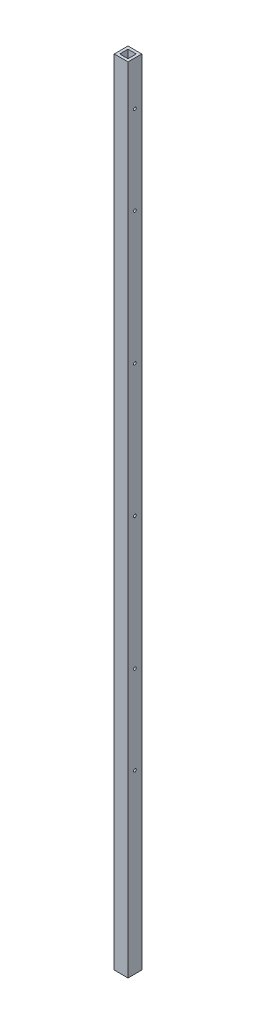
ISO-10303-21;
HEADER;
FILE_DESCRIPTION(('STEP AP214'),'2;1');
FILE_NAME('part.step','',(''),(''),'','','');
FILE_SCHEMA(('AUTOMOTIVE_DESIGN { 1 0 10303 214 1 1 1 1 }'));
ENDSEC;
DATA;
#1=APPLICATION_CONTEXT('core data for automotive mechanical design processes');
#2=APPLICATION_PROTOCOL_DEFINITION('international standard','automotive_design',2000,#1);
#3=PRODUCT_CONTEXT('',#1,'mechanical');
#4=PRODUCT('Part','Part','',(#3));
#5=PRODUCT_RELATED_PRODUCT_CATEGORY('part','',(#4));
#6=PRODUCT_DEFINITION_FORMATION('','',#4);
#7=PRODUCT_DEFINITION_CONTEXT('part definition',#1,'design');
#8=PRODUCT_DEFINITION('design','',#6,#7);
#9=PRODUCT_DEFINITION_SHAPE('','',#8);
#10=(LENGTH_UNIT() NAMED_UNIT(*) SI_UNIT(.MILLI.,.METRE.));
#11=(NAMED_UNIT(*) PLANE_ANGLE_UNIT() SI_UNIT($,.RADIAN.));
#12=(NAMED_UNIT(*) SI_UNIT($,.STERADIAN.) SOLID_ANGLE_UNIT());
#13=UNCERTAINTY_MEASURE_WITH_UNIT(LENGTH_MEASURE(1.E-05),#10,'distance_accuracy_value','');
#14=(GEOMETRIC_REPRESENTATION_CONTEXT(3) GLOBAL_UNCERTAINTY_ASSIGNED_CONTEXT((#13)) GLOBAL_UNIT_ASSIGNED_CONTEXT((#10,
#11,#12)) REPRESENTATION_CONTEXT('',''));
#15=CARTESIAN_POINT('',(0.,0.,0.));
#16=DIRECTION('',(0.,0.,1.));
#17=DIRECTION('',(1.,0.,0.));
#18=AXIS2_PLACEMENT_3D('',#15,#16,#17);
#19=CARTESIAN_POINT('',(0.,1828.8,0.));
#20=DIRECTION('',(1.,0.,0.));
#21=DIRECTION('',(0.,0.,-1.));
#22=AXIS2_PLACEMENT_3D('',#19,#20,#21);
#23=PLANE('',#22);
#24=CARTESIAN_POINT('',(0.,1524.,-15.875));
#25=DIRECTION('',(1.,0.,0.));
#26=DIRECTION('',(0.,0.,-1.));
#27=AXIS2_PLACEMENT_3D('',#24,#25,#26);
#28=CIRCLE('',#27,3.17500000000009);
#29=CARTESIAN_POINT('',(0.,1524.,-19.0500000000001));
#30=VERTEX_POINT('',#29);
#31=EDGE_CURVE('E210',#30,#30,#28,.T.);
#32=ORIENTED_EDGE('',*,*,#31,.T.);
#33=EDGE_LOOP('',(#32));
#34=FACE_BOUND('',#33,.T.);
#35=CARTESIAN_POINT('',(0.,1219.2,-15.875));
#36=DIRECTION('',(1.,0.,0.));
#37=DIRECTION('',(0.,0.,-1.));
#38=AXIS2_PLACEMENT_3D('',#35,#36,#37);
#39=CIRCLE('',#38,3.17500000000006);
#40=CARTESIAN_POINT('',(0.,1219.2,-19.0500000000001));
#41=VERTEX_POINT('',#40);
#42=EDGE_CURVE('E493',#41,#41,#39,.T.);
#43=ORIENTED_EDGE('',*,*,#42,.T.);
#44=EDGE_LOOP('',(#43));
#45=FACE_BOUND('',#44,.T.);
#46=CARTESIAN_POINT('',(0.,914.4,-15.875));
#47=DIRECTION('',(1.,0.,0.));
#48=DIRECTION('',(0.,0.,-1.));
#49=AXIS2_PLACEMENT_3D('',#46,#47,#48);
#50=CIRCLE('',#49,3.17500000000003);
#51=CARTESIAN_POINT('',(0.,914.4,-19.05));
#52=VERTEX_POINT('',#51);
#53=EDGE_CURVE('E494',#52,#52,#50,.T.);
#54=ORIENTED_EDGE('',*,*,#53,.T.);
#55=EDGE_LOOP('',(#54));
#56=FACE_BOUND('',#55,.T.);
#57=CARTESIAN_POINT('',(0.,609.6,-15.875));
#58=DIRECTION('',(1.,0.,0.));
#59=DIRECTION('',(0.,0.,-1.));
#60=AXIS2_PLACEMENT_3D('',#57,#58,#59);
#61=CIRCLE('',#60,3.175);
#62=CARTESIAN_POINT('',(0.,609.6,-19.05));
#63=VERTEX_POINT('',#62);
#64=EDGE_CURVE('E509',#63,#63,#61,.T.);
#65=ORIENTED_EDGE('',*,*,#64,.T.);
#66=EDGE_LOOP('',(#65));
#67=FACE_BOUND('',#66,.T.);
#68=CARTESIAN_POINT('',(0.,406.4,-15.875));
#69=DIRECTION('',(1.,0.,0.));
#70=DIRECTION('',(0.,0.,-1.));
#71=AXIS2_PLACEMENT_3D('',#68,#69,#70);
#72=CIRCLE('',#71,3.175);
#73=CARTESIAN_POINT('',(0.,406.4,-19.05));
#74=VERTEX_POINT('',#73);
#75=EDGE_CURVE('E517',#74,#74,#72,.T.);
#76=ORIENTED_EDGE('',*,*,#75,.T.);
#77=EDGE_LOOP('',(#76));
#78=FACE_BOUND('',#77,.T.);
#79=CARTESIAN_POINT('',(0.,1727.2,-15.875));
#80=DIRECTION('',(1.,0.,0.));
#81=DIRECTION('',(0.,0.,-1.));
#82=AXIS2_PLACEMENT_3D('',#79,#80,#81);
#83=CIRCLE('',#82,3.17500000000006);
#84=CARTESIAN_POINT('',(0.,1727.2,-19.0500000000001));
#85=VERTEX_POINT('',#84);
#86=EDGE_CURVE('E204',#85,#85,#83,.T.);
#87=ORIENTED_EDGE('',*,*,#86,.T.);
#88=EDGE_LOOP('',(#87));
#89=FACE_BOUND('',#88,.T.);
#90=DIRECTION('',(0.,0.,1.));
#91=VECTOR('',#90,1.);
#92=CARTESIAN_POINT('',(0.,0.,0.));
#93=LINE('',#92,#91);
#94=CARTESIAN_POINT('',(0.,0.,-31.75));
#95=VERTEX_POINT('',#94);
#96=CARTESIAN_POINT('',(0.,0.,0.));
#97=VERTEX_POINT('',#96);
#98=EDGE_CURVE('E158',#95,#97,#93,.T.);
#99=ORIENTED_EDGE('',*,*,#98,.T.);
#100=DIRECTION('',(0.,-1.,0.));
#101=VECTOR('',#100,1.);
#102=CARTESIAN_POINT('',(0.,1828.8,0.));
#103=LINE('',#102,#101);
#104=CARTESIAN_POINT('',(0.,1828.8,0.));
#105=VERTEX_POINT('',#104);
#106=EDGE_CURVE('E11',#105,#97,#103,.T.);
#107=ORIENTED_EDGE('',*,*,#106,.F.);
#108=DIRECTION('',(0.,0.,1.));
#109=VECTOR('',#108,1.);
#110=CARTESIAN_POINT('',(0.,1828.8,0.));
#111=LINE('',#110,#109);
#112=CARTESIAN_POINT('',(0.,1828.8,-31.75));
#113=VERTEX_POINT('',#112);
#114=EDGE_CURVE('E164',#113,#105,#111,.T.);
#115=ORIENTED_EDGE('',*,*,#114,.F.);
#116=DIRECTION('',(0.,-1.,0.));
#117=VECTOR('',#116,1.);
#118=CARTESIAN_POINT('',(0.,1828.8,-31.75));
#119=LINE('',#118,#117);
#120=EDGE_CURVE('E178',#113,#95,#119,.T.);
#121=ORIENTED_EDGE('',*,*,#120,.T.);
#122=EDGE_LOOP('',(#99,#107,#115,#121));
#123=FACE_BOUND('',#122,.T.);
#124=ADVANCED_FACE('F45',(#34,#45,#56,#67,#78,#89,#123),#23,.F.);
#125=CARTESIAN_POINT('',(0.,1828.8,0.));
#126=DIRECTION('',(0.,0.,-1.));
#127=DIRECTION('',(-1.,0.,0.));
#128=AXIS2_PLACEMENT_3D('',#125,#126,#127);
#129=PLANE('',#128);
#130=DIRECTION('',(1.,0.,0.));
#131=VECTOR('',#130,1.);
#132=CARTESIAN_POINT('',(0.,0.,0.));
#133=LINE('',#132,#131);
#134=CARTESIAN_POINT('',(31.75,0.,0.));
#135=VERTEX_POINT('',#134);
#136=EDGE_CURVE('E182',#97,#135,#133,.T.);
#137=ORIENTED_EDGE('',*,*,#136,.T.);
#138=DIRECTION('',(0.,-1.,0.));
#139=VECTOR('',#138,1.);
#140=CARTESIAN_POINT('',(31.75,1828.8,0.));
#141=LINE('',#140,#139);
#142=CARTESIAN_POINT('',(31.75,1828.8,0.));
#143=VERTEX_POINT('',#142);
#144=EDGE_CURVE('E54',#143,#135,#141,.T.);
#145=ORIENTED_EDGE('',*,*,#144,.F.);
#146=DIRECTION('',(1.,0.,0.));
#147=VECTOR('',#146,1.);
#148=CARTESIAN_POINT('',(0.,1828.8,0.));
#149=LINE('',#148,#147);
#150=EDGE_CURVE('E168',#105,#143,#149,.T.);
#151=ORIENTED_EDGE('',*,*,#150,.F.);
#152=ORIENTED_EDGE('',*,*,#106,.T.);
#153=EDGE_LOOP('',(#137,#145,#151,#152));
#154=FACE_BOUND('',#153,.T.);
#155=ADVANCED_FACE('F255',(#154),#129,.F.);
#156=CARTESIAN_POINT('',(31.75,1828.8,0.));
#157=DIRECTION('',(-1.,0.,0.));
#158=DIRECTION('',(0.,0.,1.));
#159=AXIS2_PLACEMENT_3D('',#156,#157,#158);
#160=PLANE('',#159);
#161=CARTESIAN_POINT('',(31.75,1524.,-15.875));
#162=DIRECTION('',(1.,0.,0.));
#163=DIRECTION('',(0.,0.,-1.));
#164=AXIS2_PLACEMENT_3D('',#161,#162,#163);
#165=CIRCLE('',#164,3.17500000000009);
#166=CARTESIAN_POINT('',(31.75,1524.,-19.0500000000001));
#167=VERTEX_POINT('',#166);
#168=EDGE_CURVE('E340',#167,#167,#165,.T.);
#169=ORIENTED_EDGE('',*,*,#168,.F.);
#170=EDGE_LOOP('',(#169));
#171=FACE_BOUND('',#170,.T.);
#172=CARTESIAN_POINT('',(31.75,1219.2,-15.875));
#173=DIRECTION('',(1.,0.,0.));
#174=DIRECTION('',(0.,0.,-1.));
#175=AXIS2_PLACEMENT_3D('',#172,#173,#174);
#176=CIRCLE('',#175,3.17500000000006);
#177=CARTESIAN_POINT('',(31.75,1219.2,-19.0500000000001));
#178=VERTEX_POINT('',#177);
#179=EDGE_CURVE('E499',#178,#178,#176,.T.);
#180=ORIENTED_EDGE('',*,*,#179,.F.);
#181=EDGE_LOOP('',(#180));
#182=FACE_BOUND('',#181,.T.);
#183=CARTESIAN_POINT('',(31.75,914.4,-15.875));
#184=DIRECTION('',(1.,0.,0.));
#185=DIRECTION('',(0.,0.,-1.));
#186=AXIS2_PLACEMENT_3D('',#183,#184,#185);
#187=CIRCLE('',#186,3.17500000000003);
#188=CARTESIAN_POINT('',(31.75,914.4,-19.05));
#189=VERTEX_POINT('',#188);
#190=EDGE_CURVE('E490',#189,#189,#187,.T.);
#191=ORIENTED_EDGE('',*,*,#190,.F.);
#192=EDGE_LOOP('',(#191));
#193=FACE_BOUND('',#192,.T.);
#194=CARTESIAN_POINT('',(31.75,609.6,-15.875));
#195=DIRECTION('',(1.,0.,0.));
#196=DIRECTION('',(0.,0.,-1.));
#197=AXIS2_PLACEMENT_3D('',#194,#195,#196);
#198=CIRCLE('',#197,3.175);
#199=CARTESIAN_POINT('',(31.75,609.6,-19.05));
#200=VERTEX_POINT('',#199);
#201=EDGE_CURVE('E502',#200,#200,#198,.T.);
#202=ORIENTED_EDGE('',*,*,#201,.F.);
#203=EDGE_LOOP('',(#202));
#204=FACE_BOUND('',#203,.T.);
#205=CARTESIAN_POINT('',(31.75,406.4,-15.875));
#206=DIRECTION('',(1.,0.,0.));
#207=DIRECTION('',(0.,0.,-1.));
#208=AXIS2_PLACEMENT_3D('',#205,#206,#207);
#209=CIRCLE('',#208,3.175);
#210=CARTESIAN_POINT('',(31.75,406.4,-19.05));
#211=VERTEX_POINT('',#210);
#212=EDGE_CURVE('E513',#211,#211,#209,.T.);
#213=ORIENTED_EDGE('',*,*,#212,.F.);
#214=EDGE_LOOP('',(#213));
#215=FACE_BOUND('',#214,.T.);
#216=CARTESIAN_POINT('',(31.75,1727.2,-15.875));
#217=DIRECTION('',(1.,0.,0.));
#218=DIRECTION('',(0.,0.,-1.));
#219=AXIS2_PLACEMENT_3D('',#216,#217,#218);
#220=CIRCLE('',#219,3.17500000000006);
#221=CARTESIAN_POINT('',(31.75,1727.2,-19.0500000000001));
#222=VERTEX_POINT('',#221);
#223=EDGE_CURVE('E241',#222,#222,#220,.T.);
#224=ORIENTED_EDGE('',*,*,#223,.F.);
#225=EDGE_LOOP('',(#224));
#226=FACE_BOUND('',#225,.T.);
#227=DIRECTION('',(0.,0.,-1.));
#228=VECTOR('',#227,1.);
#229=CARTESIAN_POINT('',(31.75,0.,0.));
#230=LINE('',#229,#228);
#231=CARTESIAN_POINT('',(31.75,0.,-31.75));
#232=VERTEX_POINT('',#231);
#233=EDGE_CURVE('E185',#135,#232,#230,.T.);
#234=ORIENTED_EDGE('',*,*,#233,.T.);
#235=DIRECTION('',(0.,-1.,0.));
#236=VECTOR('',#235,1.);
#237=CARTESIAN_POINT('',(31.75,1828.8,-31.75));
#238=LINE('',#237,#236);
#239=CARTESIAN_POINT('',(31.75,1828.8,-31.75));
#240=VERTEX_POINT('',#239);
#241=EDGE_CURVE('E193',#240,#232,#238,.T.);
#242=ORIENTED_EDGE('',*,*,#241,.F.);
#243=DIRECTION('',(0.,0.,-1.));
#244=VECTOR('',#243,1.);
#245=CARTESIAN_POINT('',(31.75,1828.8,0.));
#246=LINE('',#245,#244);
#247=EDGE_CURVE('E172',#143,#240,#246,.T.);
#248=ORIENTED_EDGE('',*,*,#247,.F.);
#249=ORIENTED_EDGE('',*,*,#144,.T.);
#250=EDGE_LOOP('',(#234,#242,#248,#249));
#251=FACE_BOUND('',#250,.T.);
#252=ADVANCED_FACE('F251',(#171,#182,#193,#204,#215,#226,#251),#160,.F.);
#253=CARTESIAN_POINT('',(0.,1828.8,-31.75));
#254=DIRECTION('',(0.,0.,1.));
#255=DIRECTION('',(1.,0.,0.));
#256=AXIS2_PLACEMENT_3D('',#253,#254,#255);
#257=PLANE('',#256);
#258=DIRECTION('',(-1.,0.,0.));
#259=VECTOR('',#258,1.);
#260=CARTESIAN_POINT('',(0.,0.,-31.75));
#261=LINE('',#260,#259);
#262=EDGE_CURVE('E169',#232,#95,#261,.T.);
#263=ORIENTED_EDGE('',*,*,#262,.T.);
#264=ORIENTED_EDGE('',*,*,#120,.F.);
#265=DIRECTION('',(-1.,0.,0.));
#266=VECTOR('',#265,1.);
#267=CARTESIAN_POINT('',(0.,1828.8,-31.75));
#268=LINE('',#267,#266);
#269=EDGE_CURVE('E175',#240,#113,#268,.T.);
#270=ORIENTED_EDGE('',*,*,#269,.F.);
#271=ORIENTED_EDGE('',*,*,#241,.T.);
#272=EDGE_LOOP('',(#263,#264,#270,#271));
#273=FACE_BOUND('',#272,.T.);
#274=ADVANCED_FACE('F254',(#273),#257,.F.);
#275=CARTESIAN_POINT('',(0.,1828.8,0.));
#276=DIRECTION('',(0.,-1.,0.));
#277=DIRECTION('',(0.,0.,-1.));
#278=AXIS2_PLACEMENT_3D('',#275,#276,#277);
#279=PLANE('',#278);
#280=DIRECTION('',(1.,0.,0.));
#281=VECTOR('',#280,1.);
#282=CARTESIAN_POINT('',(6.35,1828.8,-6.35));
#283=LINE('',#282,#281);
#284=CARTESIAN_POINT('',(6.35,1828.8,-6.35));
#285=VERTEX_POINT('',#284);
#286=CARTESIAN_POINT('',(25.4,1828.8,-6.35));
#287=VERTEX_POINT('',#286);
#288=EDGE_CURVE('E149',#285,#287,#283,.T.);
#289=ORIENTED_EDGE('',*,*,#288,.F.);
#290=DIRECTION('',(0.,0.,1.));
#291=VECTOR('',#290,1.);
#292=CARTESIAN_POINT('',(6.35,1828.8,-6.35));
#293=LINE('',#292,#291);
#294=CARTESIAN_POINT('',(6.35,1828.8,-25.4));
#295=VERTEX_POINT('',#294);
#296=EDGE_CURVE('E62',#295,#285,#293,.T.);
#297=ORIENTED_EDGE('',*,*,#296,.F.);
#298=DIRECTION('',(-1.,0.,0.));
#299=VECTOR('',#298,1.);
#300=CARTESIAN_POINT('',(6.35,1828.8,-25.4));
#301=LINE('',#300,#299);
#302=CARTESIAN_POINT('',(25.4,1828.8,-25.4));
#303=VERTEX_POINT('',#302);
#304=EDGE_CURVE('E133',#303,#295,#301,.T.);
#305=ORIENTED_EDGE('',*,*,#304,.F.);
#306=DIRECTION('',(0.,0.,-1.));
#307=VECTOR('',#306,1.);
#308=CARTESIAN_POINT('',(25.4,1828.8,-6.35));
#309=LINE('',#308,#307);
#310=EDGE_CURVE('E137',#287,#303,#309,.T.);
#311=ORIENTED_EDGE('',*,*,#310,.F.);
#312=EDGE_LOOP('',(#289,#297,#305,#311));
#313=FACE_BOUND('',#312,.T.);
#314=ORIENTED_EDGE('',*,*,#114,.T.);
#315=ORIENTED_EDGE('',*,*,#150,.T.);
#316=ORIENTED_EDGE('',*,*,#247,.T.);
#317=ORIENTED_EDGE('',*,*,#269,.T.);
#318=EDGE_LOOP('',(#314,#315,#316,#317));
#319=FACE_BOUND('',#318,.T.);
#320=ADVANCED_FACE('F271',(#313,#319),#279,.F.);
#321=CARTESIAN_POINT('',(0.,0.,0.));
#322=DIRECTION('',(0.,-1.,0.));
#323=DIRECTION('',(0.,0.,-1.));
#324=AXIS2_PLACEMENT_3D('',#321,#322,#323);
#325=PLANE('',#324);
#326=DIRECTION('',(0.,0.,1.));
#327=VECTOR('',#326,1.);
#328=CARTESIAN_POINT('',(6.35,0.,-6.35));
#329=LINE('',#328,#327);
#330=CARTESIAN_POINT('',(6.35,0.,-25.4));
#331=VERTEX_POINT('',#330);
#332=CARTESIAN_POINT('',(6.35,0.,-6.35));
#333=VERTEX_POINT('',#332);
#334=EDGE_CURVE('E114',#331,#333,#329,.T.);
#335=ORIENTED_EDGE('',*,*,#334,.T.);
#336=DIRECTION('',(1.,0.,0.));
#337=VECTOR('',#336,1.);
#338=CARTESIAN_POINT('',(6.35,0.,-6.35));
#339=LINE('',#338,#337);
#340=CARTESIAN_POINT('',(25.4,0.,-6.35));
#341=VERTEX_POINT('',#340);
#342=EDGE_CURVE('E124',#333,#341,#339,.T.);
#343=ORIENTED_EDGE('',*,*,#342,.T.);
#344=DIRECTION('',(0.,0.,-1.));
#345=VECTOR('',#344,1.);
#346=CARTESIAN_POINT('',(25.4,0.,-6.35));
#347=LINE('',#346,#345);
#348=CARTESIAN_POINT('',(25.4,0.,-25.4));
#349=VERTEX_POINT('',#348);
#350=EDGE_CURVE('E70',#341,#349,#347,.T.);
#351=ORIENTED_EDGE('',*,*,#350,.T.);
#352=DIRECTION('',(-1.,0.,0.));
#353=VECTOR('',#352,1.);
#354=CARTESIAN_POINT('',(6.35,0.,-25.4));
#355=LINE('',#354,#353);
#356=EDGE_CURVE('E121',#349,#331,#355,.T.);
#357=ORIENTED_EDGE('',*,*,#356,.T.);
#358=EDGE_LOOP('',(#335,#343,#351,#357));
#359=FACE_BOUND('',#358,.T.);
#360=ORIENTED_EDGE('',*,*,#98,.F.);
#361=ORIENTED_EDGE('',*,*,#262,.F.);
#362=ORIENTED_EDGE('',*,*,#233,.F.);
#363=ORIENTED_EDGE('',*,*,#136,.F.);
#364=EDGE_LOOP('',(#360,#361,#362,#363));
#365=FACE_BOUND('',#364,.T.);
#366=ADVANCED_FACE('F129',(#359,#365),#325,.T.);
#367=CARTESIAN_POINT('',(6.35,0.,-6.35));
#368=DIRECTION('',(-1.,0.,0.));
#369=DIRECTION('',(0.,0.,1.));
#370=AXIS2_PLACEMENT_3D('',#367,#368,#369);
#371=PLANE('',#370);
#372=CARTESIAN_POINT('',(6.35,1524.,-15.875));
#373=DIRECTION('',(-1.,0.,0.));
#374=DIRECTION('',(0.,0.,1.));
#375=AXIS2_PLACEMENT_3D('',#372,#373,#374);
#376=CIRCLE('',#375,3.17500000000009);
#377=CARTESIAN_POINT('',(6.35,1524.,-12.6999999999999));
#378=VERTEX_POINT('',#377);
#379=EDGE_CURVE('E237',#378,#378,#376,.T.);
#380=ORIENTED_EDGE('',*,*,#379,.T.);
#381=EDGE_LOOP('',(#380));
#382=FACE_BOUND('',#381,.T.);
#383=CARTESIAN_POINT('',(6.35,1219.2,-15.875));
#384=DIRECTION('',(-1.,0.,0.));
#385=DIRECTION('',(0.,0.,1.));
#386=AXIS2_PLACEMENT_3D('',#383,#384,#385);
#387=CIRCLE('',#386,3.17500000000006);
#388=CARTESIAN_POINT('',(6.35,1219.2,-12.6999999999999));
#389=VERTEX_POINT('',#388);
#390=EDGE_CURVE('E223',#389,#389,#387,.T.);
#391=ORIENTED_EDGE('',*,*,#390,.T.);
#392=EDGE_LOOP('',(#391));
#393=FACE_BOUND('',#392,.T.);
#394=CARTESIAN_POINT('',(6.35,914.4,-15.875));
#395=DIRECTION('',(-1.,0.,0.));
#396=DIRECTION('',(0.,0.,1.));
#397=AXIS2_PLACEMENT_3D('',#394,#395,#396);
#398=CIRCLE('',#397,3.17500000000003);
#399=CARTESIAN_POINT('',(6.35,914.4,-12.7));
#400=VERTEX_POINT('',#399);
#401=EDGE_CURVE('E219',#400,#400,#398,.T.);
#402=ORIENTED_EDGE('',*,*,#401,.T.);
#403=EDGE_LOOP('',(#402));
#404=FACE_BOUND('',#403,.T.);
#405=CARTESIAN_POINT('',(6.35,609.6,-15.875));
#406=DIRECTION('',(-1.,0.,0.));
#407=DIRECTION('',(0.,0.,1.));
#408=AXIS2_PLACEMENT_3D('',#405,#406,#407);
#409=CIRCLE('',#408,3.175);
#410=CARTESIAN_POINT('',(6.35,609.6,-12.7));
#411=VERTEX_POINT('',#410);
#412=EDGE_CURVE('E215',#411,#411,#409,.T.);
#413=ORIENTED_EDGE('',*,*,#412,.T.);
#414=EDGE_LOOP('',(#413));
#415=FACE_BOUND('',#414,.T.);
#416=CARTESIAN_POINT('',(6.35,406.4,-15.875));
#417=DIRECTION('',(-1.,0.,0.));
#418=DIRECTION('',(0.,0.,1.));
#419=AXIS2_PLACEMENT_3D('',#416,#417,#418);
#420=CIRCLE('',#419,3.175);
#421=CARTESIAN_POINT('',(6.35,406.4,-12.7));
#422=VERTEX_POINT('',#421);
#423=EDGE_CURVE('E209',#422,#422,#420,.T.);
#424=ORIENTED_EDGE('',*,*,#423,.T.);
#425=EDGE_LOOP('',(#424));
#426=FACE_BOUND('',#425,.T.);
#427=CARTESIAN_POINT('',(6.35,1727.2,-15.875));
#428=DIRECTION('',(-1.,0.,0.));
#429=DIRECTION('',(0.,0.,1.));
#430=AXIS2_PLACEMENT_3D('',#427,#428,#429);
#431=CIRCLE('',#430,3.17500000000006);
#432=CARTESIAN_POINT('',(6.35,1727.2,-12.6999999999999));
#433=VERTEX_POINT('',#432);
#434=EDGE_CURVE('E140',#433,#433,#431,.T.);
#435=ORIENTED_EDGE('',*,*,#434,.T.);
#436=EDGE_LOOP('',(#435));
#437=FACE_BOUND('',#436,.T.);
#438=ORIENTED_EDGE('',*,*,#296,.T.);
#439=DIRECTION('',(0.,1.,0.));
#440=VECTOR('',#439,1.);
#441=CARTESIAN_POINT('',(6.35,0.,-6.35));
#442=LINE('',#441,#440);
#443=EDGE_CURVE('E110',#333,#285,#442,.T.);
#444=ORIENTED_EDGE('',*,*,#443,.F.);
#445=ORIENTED_EDGE('',*,*,#334,.F.);
#446=DIRECTION('',(0.,1.,0.));
#447=VECTOR('',#446,1.);
#448=CARTESIAN_POINT('',(6.35,0.,-25.4));
#449=LINE('',#448,#447);
#450=EDGE_CURVE('E155',#331,#295,#449,.T.);
#451=ORIENTED_EDGE('',*,*,#450,.T.);
#452=EDGE_LOOP('',(#438,#444,#445,#451));
#453=FACE_BOUND('',#452,.T.);
#454=ADVANCED_FACE('F112',(#382,#393,#404,#415,#426,#437,#453),#371,.F.);
#455=CARTESIAN_POINT('',(6.35,0.,-25.4));
#456=DIRECTION('',(0.,0.,-1.));
#457=DIRECTION('',(-1.,0.,0.));
#458=AXIS2_PLACEMENT_3D('',#455,#456,#457);
#459=PLANE('',#458);
#460=ORIENTED_EDGE('',*,*,#304,.T.);
#461=ORIENTED_EDGE('',*,*,#450,.F.);
#462=ORIENTED_EDGE('',*,*,#356,.F.);
#463=DIRECTION('',(0.,1.,0.));
#464=VECTOR('',#463,1.);
#465=CARTESIAN_POINT('',(25.4,0.,-25.4));
#466=LINE('',#465,#464);
#467=EDGE_CURVE('E159',#349,#303,#466,.T.);
#468=ORIENTED_EDGE('',*,*,#467,.T.);
#469=EDGE_LOOP('',(#460,#461,#462,#468));
#470=FACE_BOUND('',#469,.T.);
#471=ADVANCED_FACE('F288',(#470),#459,.F.);
#472=CARTESIAN_POINT('',(25.4,0.,-6.35));
#473=DIRECTION('',(1.,0.,0.));
#474=DIRECTION('',(0.,0.,-1.));
#475=AXIS2_PLACEMENT_3D('',#472,#473,#474);
#476=PLANE('',#475);
#477=CARTESIAN_POINT('',(25.4,1524.,-15.875));
#478=DIRECTION('',(1.,0.,0.));
#479=DIRECTION('',(0.,0.,-1.));
#480=AXIS2_PLACEMENT_3D('',#477,#478,#479);
#481=CIRCLE('',#480,3.17500000000009);
#482=CARTESIAN_POINT('',(25.4,1524.,-19.0500000000001));
#483=VERTEX_POINT('',#482);
#484=EDGE_CURVE('E48',#483,#483,#481,.T.);
#485=ORIENTED_EDGE('',*,*,#484,.T.);
#486=EDGE_LOOP('',(#485));
#487=FACE_BOUND('',#486,.T.);
#488=CARTESIAN_POINT('',(25.4,1219.2,-15.875));
#489=DIRECTION('',(1.,0.,0.));
#490=DIRECTION('',(0.,0.,-1.));
#491=AXIS2_PLACEMENT_3D('',#488,#489,#490);
#492=CIRCLE('',#491,3.17500000000006);
#493=CARTESIAN_POINT('',(25.4,1219.2,-19.0500000000001));
#494=VERTEX_POINT('',#493);
#495=EDGE_CURVE('E220',#494,#494,#492,.T.);
#496=ORIENTED_EDGE('',*,*,#495,.T.);
#497=EDGE_LOOP('',(#496));
#498=FACE_BOUND('',#497,.T.);
#499=CARTESIAN_POINT('',(25.4,914.4,-15.875));
#500=DIRECTION('',(1.,0.,0.));
#501=DIRECTION('',(0.,0.,-1.));
#502=AXIS2_PLACEMENT_3D('',#499,#500,#501);
#503=CIRCLE('',#502,3.17500000000003);
#504=CARTESIAN_POINT('',(25.4,914.4,-19.05));
#505=VERTEX_POINT('',#504);
#506=EDGE_CURVE('E216',#505,#505,#503,.T.);
#507=ORIENTED_EDGE('',*,*,#506,.T.);
#508=EDGE_LOOP('',(#507));
#509=FACE_BOUND('',#508,.T.);
#510=CARTESIAN_POINT('',(25.4,609.6,-15.875));
#511=DIRECTION('',(1.,0.,0.));
#512=DIRECTION('',(0.,0.,-1.));
#513=AXIS2_PLACEMENT_3D('',#510,#511,#512);
#514=CIRCLE('',#513,3.175);
#515=CARTESIAN_POINT('',(25.4,609.6,-19.05));
#516=VERTEX_POINT('',#515);
#517=EDGE_CURVE('E211',#516,#516,#514,.T.);
#518=ORIENTED_EDGE('',*,*,#517,.T.);
#519=EDGE_LOOP('',(#518));
#520=FACE_BOUND('',#519,.T.);
#521=CARTESIAN_POINT('',(25.4,406.4,-15.875));
#522=DIRECTION('',(1.,0.,0.));
#523=DIRECTION('',(0.,0.,-1.));
#524=AXIS2_PLACEMENT_3D('',#521,#522,#523);
#525=CIRCLE('',#524,3.175);
#526=CARTESIAN_POINT('',(25.4,406.4,-19.05));
#527=VERTEX_POINT('',#526);
#528=EDGE_CURVE('E205',#527,#527,#525,.T.);
#529=ORIENTED_EDGE('',*,*,#528,.T.);
#530=EDGE_LOOP('',(#529));
#531=FACE_BOUND('',#530,.T.);
#532=CARTESIAN_POINT('',(25.4,1727.2,-15.875));
#533=DIRECTION('',(1.,0.,0.));
#534=DIRECTION('',(0.,0.,-1.));
#535=AXIS2_PLACEMENT_3D('',#532,#533,#534);
#536=CIRCLE('',#535,3.17500000000006);
#537=CARTESIAN_POINT('',(25.4,1727.2,-19.0500000000001));
#538=VERTEX_POINT('',#537);
#539=EDGE_CURVE('E200',#538,#538,#536,.T.);
#540=ORIENTED_EDGE('',*,*,#539,.T.);
#541=EDGE_LOOP('',(#540));
#542=FACE_BOUND('',#541,.T.);
#543=ORIENTED_EDGE('',*,*,#310,.T.);
#544=ORIENTED_EDGE('',*,*,#467,.F.);
#545=ORIENTED_EDGE('',*,*,#350,.F.);
#546=DIRECTION('',(0.,1.,0.));
#547=VECTOR('',#546,1.);
#548=CARTESIAN_POINT('',(25.4,0.,-6.35));
#549=LINE('',#548,#547);
#550=EDGE_CURVE('E120',#341,#287,#549,.T.);
#551=ORIENTED_EDGE('',*,*,#550,.T.);
#552=EDGE_LOOP('',(#543,#544,#545,#551));
#553=FACE_BOUND('',#552,.T.);
#554=ADVANCED_FACE('F292',(#487,#498,#509,#520,#531,#542,#553),#476,.F.);
#555=CARTESIAN_POINT('',(6.35,0.,-6.35));
#556=DIRECTION('',(0.,0.,1.));
#557=DIRECTION('',(1.,0.,0.));
#558=AXIS2_PLACEMENT_3D('',#555,#556,#557);
#559=PLANE('',#558);
#560=ORIENTED_EDGE('',*,*,#288,.T.);
#561=ORIENTED_EDGE('',*,*,#550,.F.);
#562=ORIENTED_EDGE('',*,*,#342,.F.);
#563=ORIENTED_EDGE('',*,*,#443,.T.);
#564=EDGE_LOOP('',(#560,#561,#562,#563));
#565=FACE_BOUND('',#564,.T.);
#566=ADVANCED_FACE('F125',(#565),#559,.F.);
#567=CARTESIAN_POINT('',(0.,1727.2,-15.875));
#568=DIRECTION('',(1.,0.,0.));
#569=DIRECTION('',(0.,0.,-1.));
#570=AXIS2_PLACEMENT_3D('',#567,#568,#569);
#571=CYLINDRICAL_SURFACE('',#570,3.17500000000006);
#572=ORIENTED_EDGE('',*,*,#223,.T.);
#573=EDGE_LOOP('',(#572));
#574=FACE_BOUND('',#573,.T.);
#575=ORIENTED_EDGE('',*,*,#539,.F.);
#576=EDGE_LOOP('',(#575));
#577=FACE_BOUND('',#576,.T.);
#578=ADVANCED_FACE('F248',(#574,#577),#571,.F.);
#579=ORIENTED_EDGE('',*,*,#86,.F.);
#580=EDGE_LOOP('',(#579));
#581=FACE_BOUND('',#580,.T.);
#582=ORIENTED_EDGE('',*,*,#434,.F.);
#583=EDGE_LOOP('',(#582));
#584=FACE_BOUND('',#583,.T.);
#585=ADVANCED_FACE('F299',(#581,#584),#571,.F.);
#586=CARTESIAN_POINT('',(0.,406.4,-15.875));
#587=DIRECTION('',(1.,0.,0.));
#588=DIRECTION('',(0.,0.,-1.));
#589=AXIS2_PLACEMENT_3D('',#586,#587,#588);
#590=CYLINDRICAL_SURFACE('',#589,3.175);
#591=ORIENTED_EDGE('',*,*,#212,.T.);
#592=EDGE_LOOP('',(#591));
#593=FACE_BOUND('',#592,.T.);
#594=ORIENTED_EDGE('',*,*,#528,.F.);
#595=EDGE_LOOP('',(#594));
#596=FACE_BOUND('',#595,.T.);
#597=ADVANCED_FACE('F302',(#593,#596),#590,.F.);
#598=CARTESIAN_POINT('',(0.,609.6,-15.875));
#599=DIRECTION('',(1.,0.,0.));
#600=DIRECTION('',(0.,0.,-1.));
#601=AXIS2_PLACEMENT_3D('',#598,#599,#600);
#602=CYLINDRICAL_SURFACE('',#601,3.175);
#603=ORIENTED_EDGE('',*,*,#201,.T.);
#604=EDGE_LOOP('',(#603));
#605=FACE_BOUND('',#604,.T.);
#606=ORIENTED_EDGE('',*,*,#517,.F.);
#607=EDGE_LOOP('',(#606));
#608=FACE_BOUND('',#607,.T.);
#609=ADVANCED_FACE('F314',(#605,#608),#602,.F.);
#610=CARTESIAN_POINT('',(0.,914.4,-15.875));
#611=DIRECTION('',(1.,0.,0.));
#612=DIRECTION('',(0.,0.,-1.));
#613=AXIS2_PLACEMENT_3D('',#610,#611,#612);
#614=CYLINDRICAL_SURFACE('',#613,3.17500000000003);
#615=ORIENTED_EDGE('',*,*,#190,.T.);
#616=EDGE_LOOP('',(#615));
#617=FACE_BOUND('',#616,.T.);
#618=ORIENTED_EDGE('',*,*,#506,.F.);
#619=EDGE_LOOP('',(#618));
#620=FACE_BOUND('',#619,.T.);
#621=ADVANCED_FACE('F319',(#617,#620),#614,.F.);
#622=CARTESIAN_POINT('',(0.,1219.2,-15.875));
#623=DIRECTION('',(1.,0.,0.));
#624=DIRECTION('',(0.,0.,-1.));
#625=AXIS2_PLACEMENT_3D('',#622,#623,#624);
#626=CYLINDRICAL_SURFACE('',#625,3.17500000000006);
#627=ORIENTED_EDGE('',*,*,#179,.T.);
#628=EDGE_LOOP('',(#627));
#629=FACE_BOUND('',#628,.T.);
#630=ORIENTED_EDGE('',*,*,#495,.F.);
#631=EDGE_LOOP('',(#630));
#632=FACE_BOUND('',#631,.T.);
#633=ADVANCED_FACE('F324',(#629,#632),#626,.F.);
#634=CARTESIAN_POINT('',(0.,1524.,-15.875));
#635=DIRECTION('',(1.,0.,0.));
#636=DIRECTION('',(0.,0.,-1.));
#637=AXIS2_PLACEMENT_3D('',#634,#635,#636);
#638=CYLINDRICAL_SURFACE('',#637,3.17500000000009);
#639=ORIENTED_EDGE('',*,*,#168,.T.);
#640=EDGE_LOOP('',(#639));
#641=FACE_BOUND('',#640,.T.);
#642=ORIENTED_EDGE('',*,*,#484,.F.);
#643=EDGE_LOOP('',(#642));
#644=FACE_BOUND('',#643,.T.);
#645=ADVANCED_FACE('F308',(#641,#644),#638,.F.);
#646=ORIENTED_EDGE('',*,*,#75,.F.);
#647=EDGE_LOOP('',(#646));
#648=FACE_BOUND('',#647,.T.);
#649=ORIENTED_EDGE('',*,*,#423,.F.);
#650=EDGE_LOOP('',(#649));
#651=FACE_BOUND('',#650,.T.);
#652=ADVANCED_FACE('F304',(#648,#651),#590,.F.);
#653=ORIENTED_EDGE('',*,*,#64,.F.);
#654=EDGE_LOOP('',(#653));
#655=FACE_BOUND('',#654,.T.);
#656=ORIENTED_EDGE('',*,*,#412,.F.);
#657=EDGE_LOOP('',(#656));
#658=FACE_BOUND('',#657,.T.);
#659=ADVANCED_FACE('F307',(#655,#658),#602,.F.);
#660=ORIENTED_EDGE('',*,*,#53,.F.);
#661=EDGE_LOOP('',(#660));
#662=FACE_BOUND('',#661,.T.);
#663=ORIENTED_EDGE('',*,*,#401,.F.);
#664=EDGE_LOOP('',(#663));
#665=FACE_BOUND('',#664,.T.);
#666=ADVANCED_FACE('F312',(#662,#665),#614,.F.);
#667=ORIENTED_EDGE('',*,*,#42,.F.);
#668=EDGE_LOOP('',(#667));
#669=FACE_BOUND('',#668,.T.);
#670=ORIENTED_EDGE('',*,*,#390,.F.);
#671=EDGE_LOOP('',(#670));
#672=FACE_BOUND('',#671,.T.);
#673=ADVANCED_FACE('F317',(#669,#672),#626,.F.);
#674=ORIENTED_EDGE('',*,*,#31,.F.);
#675=EDGE_LOOP('',(#674));
#676=FACE_BOUND('',#675,.T.);
#677=ORIENTED_EDGE('',*,*,#379,.F.);
#678=EDGE_LOOP('',(#677));
#679=FACE_BOUND('',#678,.T.);
#680=ADVANCED_FACE('F322',(#676,#679),#638,.F.);
#681=CLOSED_SHELL('',(#124,#155,#252,#274,#320,#366,#454,#471,#554,#566,#578,#585,#597,#609,
#621,#633,#645,#652,#659,#666,#673,#680));
#682=MANIFOLD_SOLID_BREP('B2',#681);
#683=ADVANCED_BREP_SHAPE_REPRESENTATION('',(#18,#682),#14);
#684=SHAPE_DEFINITION_REPRESENTATION(#9,#683);
ENDSEC;
END-ISO-10303-21;
